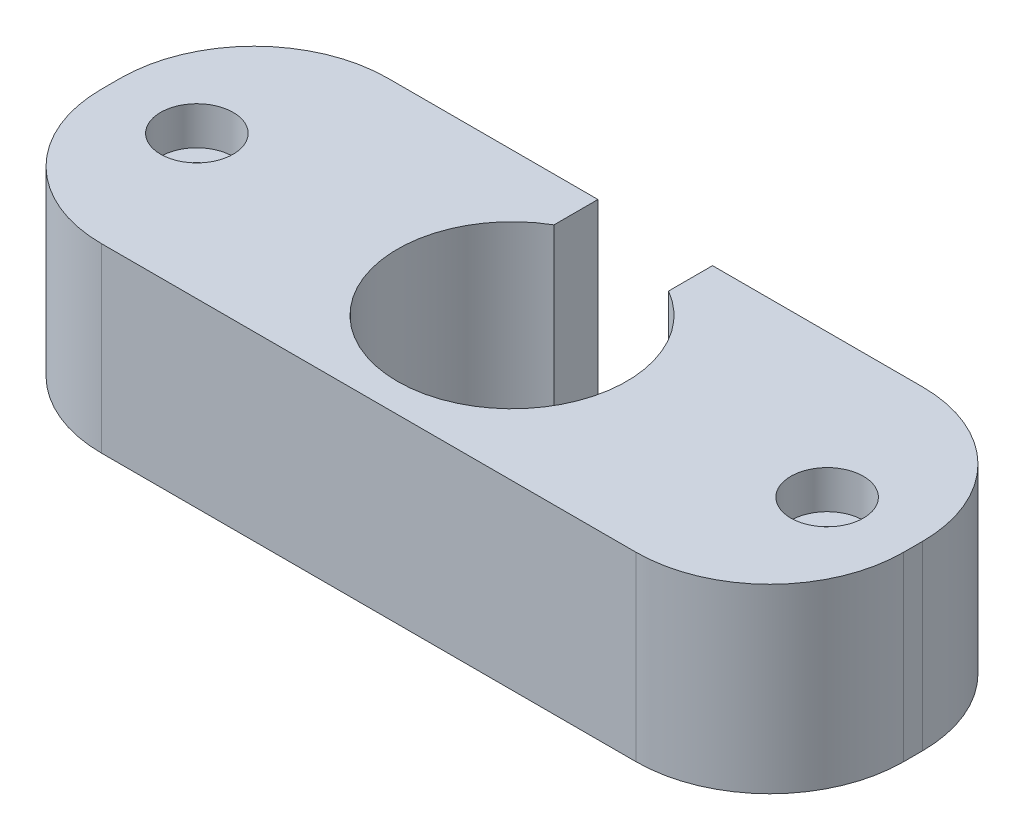
ISO-10303-21;
HEADER;
FILE_DESCRIPTION(('STEP AP214'),'2;1');
FILE_NAME('part.step','',(''),(''),'','','');
FILE_SCHEMA(('AUTOMOTIVE_DESIGN { 1 0 10303 214 1 1 1 1 }'));
ENDSEC;
DATA;
#1=APPLICATION_CONTEXT('core data for automotive mechanical design processes');
#2=APPLICATION_PROTOCOL_DEFINITION('international standard','automotive_design',2000,#1);
#3=PRODUCT_CONTEXT('',#1,'mechanical');
#4=PRODUCT('Part','Part','',(#3));
#5=PRODUCT_RELATED_PRODUCT_CATEGORY('part','',(#4));
#6=PRODUCT_DEFINITION_FORMATION('','',#4);
#7=PRODUCT_DEFINITION_CONTEXT('part definition',#1,'design');
#8=PRODUCT_DEFINITION('design','',#6,#7);
#9=PRODUCT_DEFINITION_SHAPE('','',#8);
#10=(LENGTH_UNIT() NAMED_UNIT(*) SI_UNIT(.MILLI.,.METRE.));
#11=(NAMED_UNIT(*) PLANE_ANGLE_UNIT() SI_UNIT($,.RADIAN.));
#12=(NAMED_UNIT(*) SI_UNIT($,.STERADIAN.) SOLID_ANGLE_UNIT());
#13=UNCERTAINTY_MEASURE_WITH_UNIT(LENGTH_MEASURE(1.E-05),#10,'distance_accuracy_value','');
#14=(GEOMETRIC_REPRESENTATION_CONTEXT(3) GLOBAL_UNCERTAINTY_ASSIGNED_CONTEXT((#13)) GLOBAL_UNIT_ASSIGNED_CONTEXT((#10,
#11,#12)) REPRESENTATION_CONTEXT('',''));
#15=CARTESIAN_POINT('',(0.,0.,0.));
#16=DIRECTION('',(0.,0.,1.));
#17=DIRECTION('',(1.,0.,0.));
#18=AXIS2_PLACEMENT_3D('',#15,#16,#17);
#19=CARTESIAN_POINT('',(0.,-9.5,-15.));
#20=DIRECTION('',(0.,0.,-1.));
#21=DIRECTION('',(-1.,0.,0.));
#22=AXIS2_PLACEMENT_3D('',#19,#20,#21);
#23=PLANE('',#22);
#24=DIRECTION('',(0.,-1.,0.));
#25=VECTOR('',#24,1.);
#26=CARTESIAN_POINT('',(24.,0.,-15.));
#27=LINE('',#26,#25);
#28=CARTESIAN_POINT('',(24.,0.,-15.));
#29=VERTEX_POINT('',#28);
#30=CARTESIAN_POINT('',(24.,-9.5,-15.));
#31=VERTEX_POINT('',#30);
#32=EDGE_CURVE('E128',#29,#31,#27,.T.);
#33=ORIENTED_EDGE('',*,*,#32,.F.);
#34=DIRECTION('',(-1.,0.,0.));
#35=VECTOR('',#34,1.);
#36=CARTESIAN_POINT('',(0.,0.,-15.));
#37=LINE('',#36,#35);
#38=CARTESIAN_POINT('',(35.,0.,-15.));
#39=VERTEX_POINT('',#38);
#40=EDGE_CURVE('E180',#39,#29,#37,.T.);
#41=ORIENTED_EDGE('',*,*,#40,.F.);
#42=DIRECTION('',(0.,1.,0.));
#43=VECTOR('',#42,1.);
#44=CARTESIAN_POINT('',(35.,-9.5,-15.));
#45=LINE('',#44,#43);
#46=CARTESIAN_POINT('',(35.,-9.5,-15.));
#47=VERTEX_POINT('',#46);
#48=EDGE_CURVE('E153',#39,#47,#45,.F.);
#49=ORIENTED_EDGE('',*,*,#48,.T.);
#50=DIRECTION('',(-1.,0.,0.));
#51=VECTOR('',#50,1.);
#52=CARTESIAN_POINT('',(0.,-9.5,-15.));
#53=LINE('',#52,#51);
#54=EDGE_CURVE('E144',#47,#31,#53,.T.);
#55=ORIENTED_EDGE('',*,*,#54,.T.);
#56=EDGE_LOOP('',(#33,#41,#49,#55));
#57=FACE_BOUND('',#56,.T.);
#58=ADVANCED_FACE('F41',(#57),#23,.T.);
#59=CARTESIAN_POINT('',(0.,-9.5,0.));
#60=DIRECTION('',(-1.,0.,0.));
#61=DIRECTION('',(0.,0.,1.));
#62=AXIS2_PLACEMENT_3D('',#59,#60,#61);
#63=PLANE('',#62);
#64=DIRECTION('',(0.,0.,1.));
#65=VECTOR('',#64,1.);
#66=CARTESIAN_POINT('',(0.,-9.5,0.));
#67=LINE('',#66,#65);
#68=CARTESIAN_POINT('',(0.,-9.5,-8.));
#69=VERTEX_POINT('',#68);
#70=CARTESIAN_POINT('',(0.,-9.5,-7.));
#71=VERTEX_POINT('',#70);
#72=EDGE_CURVE('E183',#69,#71,#67,.T.);
#73=ORIENTED_EDGE('',*,*,#72,.T.);
#74=DIRECTION('',(0.,1.,0.));
#75=VECTOR('',#74,1.);
#76=CARTESIAN_POINT('',(0.,-9.5,-7.));
#77=LINE('',#76,#75);
#78=CARTESIAN_POINT('',(0.,0.,-7.));
#79=VERTEX_POINT('',#78);
#80=EDGE_CURVE('E232',#71,#79,#77,.T.);
#81=ORIENTED_EDGE('',*,*,#80,.T.);
#82=DIRECTION('',(0.,0.,1.));
#83=VECTOR('',#82,1.);
#84=CARTESIAN_POINT('',(0.,0.,0.));
#85=LINE('',#84,#83);
#86=CARTESIAN_POINT('',(0.,0.,-8.));
#87=VERTEX_POINT('',#86);
#88=EDGE_CURVE('E166',#87,#79,#85,.T.);
#89=ORIENTED_EDGE('',*,*,#88,.F.);
#90=DIRECTION('',(0.,1.,0.));
#91=VECTOR('',#90,1.);
#92=CARTESIAN_POINT('',(0.,-9.5,-8.));
#93=LINE('',#92,#91);
#94=EDGE_CURVE('E229',#87,#69,#93,.F.);
#95=ORIENTED_EDGE('',*,*,#94,.T.);
#96=EDGE_LOOP('',(#73,#81,#89,#95));
#97=FACE_BOUND('',#96,.T.);
#98=ADVANCED_FACE('F287',(#97),#63,.T.);
#99=DIRECTION('',(0.,1.,0.));
#100=VECTOR('',#99,1.);
#101=CARTESIAN_POINT('',(18.,0.,-15.));
#102=LINE('',#101,#100);
#103=CARTESIAN_POINT('',(18.,-9.5,-15.));
#104=VERTEX_POINT('',#103);
#105=CARTESIAN_POINT('',(18.,0.,-15.));
#106=VERTEX_POINT('',#105);
#107=EDGE_CURVE('E137',#104,#106,#102,.T.);
#108=ORIENTED_EDGE('',*,*,#107,.F.);
#109=CARTESIAN_POINT('',(7.,-9.5,-15.));
#110=VERTEX_POINT('',#109);
#111=EDGE_CURVE('E156',#104,#110,#53,.T.);
#112=ORIENTED_EDGE('',*,*,#111,.T.);
#113=DIRECTION('',(0.,1.,0.));
#114=VECTOR('',#113,1.);
#115=CARTESIAN_POINT('',(7.,-9.5,-15.));
#116=LINE('',#115,#114);
#117=CARTESIAN_POINT('',(7.,0.,-15.));
#118=VERTEX_POINT('',#117);
#119=EDGE_CURVE('E236',#110,#118,#116,.T.);
#120=ORIENTED_EDGE('',*,*,#119,.T.);
#121=EDGE_CURVE('E179',#106,#118,#37,.T.);
#122=ORIENTED_EDGE('',*,*,#121,.F.);
#123=EDGE_LOOP('',(#108,#112,#120,#122));
#124=FACE_BOUND('',#123,.T.);
#125=ADVANCED_FACE('F296',(#124),#23,.T.);
#126=CARTESIAN_POINT('',(42.,-9.5,0.));
#127=DIRECTION('',(1.,0.,0.));
#128=DIRECTION('',(0.,0.,-1.));
#129=AXIS2_PLACEMENT_3D('',#126,#127,#128);
#130=PLANE('',#129);
#131=DIRECTION('',(0.,0.,-1.));
#132=VECTOR('',#131,1.);
#133=CARTESIAN_POINT('',(42.,0.,0.));
#134=LINE('',#133,#132);
#135=CARTESIAN_POINT('',(42.,0.,-7.));
#136=VERTEX_POINT('',#135);
#137=CARTESIAN_POINT('',(42.,0.,-8.));
#138=VERTEX_POINT('',#137);
#139=EDGE_CURVE('E175',#136,#138,#134,.T.);
#140=ORIENTED_EDGE('',*,*,#139,.F.);
#141=DIRECTION('',(0.,1.,0.));
#142=VECTOR('',#141,1.);
#143=CARTESIAN_POINT('',(42.,-9.5,-7.));
#144=LINE('',#143,#142);
#145=CARTESIAN_POINT('',(42.,-9.5,-7.));
#146=VERTEX_POINT('',#145);
#147=EDGE_CURVE('E213',#136,#146,#144,.F.);
#148=ORIENTED_EDGE('',*,*,#147,.T.);
#149=DIRECTION('',(0.,0.,-1.));
#150=VECTOR('',#149,1.);
#151=CARTESIAN_POINT('',(42.,-9.5,0.));
#152=LINE('',#151,#150);
#153=CARTESIAN_POINT('',(42.,-9.5,-8.));
#154=VERTEX_POINT('',#153);
#155=EDGE_CURVE('E162',#146,#154,#152,.T.);
#156=ORIENTED_EDGE('',*,*,#155,.T.);
#157=DIRECTION('',(0.,1.,0.));
#158=VECTOR('',#157,1.);
#159=CARTESIAN_POINT('',(42.,-9.5,-8.));
#160=LINE('',#159,#158);
#161=EDGE_CURVE('E209',#154,#138,#160,.T.);
#162=ORIENTED_EDGE('',*,*,#161,.T.);
#163=EDGE_LOOP('',(#140,#148,#156,#162));
#164=FACE_BOUND('',#163,.T.);
#165=ADVANCED_FACE('F272',(#164),#130,.T.);
#166=CARTESIAN_POINT('',(0.,-9.5,0.));
#167=DIRECTION('',(0.,0.,1.));
#168=DIRECTION('',(1.,0.,0.));
#169=AXIS2_PLACEMENT_3D('',#166,#167,#168);
#170=PLANE('',#169);
#171=DIRECTION('',(1.,0.,0.));
#172=VECTOR('',#171,1.);
#173=CARTESIAN_POINT('',(0.,-9.5,0.));
#174=LINE('',#173,#172);
#175=CARTESIAN_POINT('',(7.,-9.5,0.));
#176=VERTEX_POINT('',#175);
#177=CARTESIAN_POINT('',(35.,-9.5,0.));
#178=VERTEX_POINT('',#177);
#179=EDGE_CURVE('E260',#176,#178,#174,.T.);
#180=ORIENTED_EDGE('',*,*,#179,.T.);
#181=DIRECTION('',(0.,1.,0.));
#182=VECTOR('',#181,1.);
#183=CARTESIAN_POINT('',(35.,-9.5,0.));
#184=LINE('',#183,#182);
#185=CARTESIAN_POINT('',(35.,0.,0.));
#186=VERTEX_POINT('',#185);
#187=EDGE_CURVE('E160',#178,#186,#184,.T.);
#188=ORIENTED_EDGE('',*,*,#187,.T.);
#189=DIRECTION('',(1.,0.,0.));
#190=VECTOR('',#189,1.);
#191=CARTESIAN_POINT('',(0.,0.,0.));
#192=LINE('',#191,#190);
#193=CARTESIAN_POINT('',(7.,0.,0.));
#194=VERTEX_POINT('',#193);
#195=EDGE_CURVE('E170',#194,#186,#192,.T.);
#196=ORIENTED_EDGE('',*,*,#195,.F.);
#197=DIRECTION('',(0.,1.,0.));
#198=VECTOR('',#197,1.);
#199=CARTESIAN_POINT('',(7.,-9.5,0.));
#200=LINE('',#199,#198);
#201=EDGE_CURVE('E155',#194,#176,#200,.F.);
#202=ORIENTED_EDGE('',*,*,#201,.T.);
#203=EDGE_LOOP('',(#180,#188,#196,#202));
#204=FACE_BOUND('',#203,.T.);
#205=ADVANCED_FACE('F351',(#204),#170,.T.);
#206=CARTESIAN_POINT('',(0.,-9.5,0.));
#207=DIRECTION('',(0.,-1.,0.));
#208=DIRECTION('',(0.,0.,-1.));
#209=AXIS2_PLACEMENT_3D('',#206,#207,#208);
#210=PLANE('',#209);
#211=DIRECTION('',(0.,0.,-1.));
#212=VECTOR('',#211,1.);
#213=CARTESIAN_POINT('',(24.,-9.5,-12.));
#214=LINE('',#213,#212);
#215=CARTESIAN_POINT('',(24.,-9.5,-12.6961524227066));
#216=VERTEX_POINT('',#215);
#217=EDGE_CURVE('E65',#216,#31,#214,.T.);
#218=ORIENTED_EDGE('',*,*,#217,.T.);
#219=ORIENTED_EDGE('',*,*,#54,.F.);
#220=CARTESIAN_POINT('',(35.,-9.5,-8.));
#221=DIRECTION('',(0.,-1.,0.));
#222=DIRECTION('',(0.,0.,-1.));
#223=AXIS2_PLACEMENT_3D('',#220,#221,#222);
#224=CIRCLE('',#223,7.);
#225=EDGE_CURVE('E220',#47,#154,#224,.T.);
#226=ORIENTED_EDGE('',*,*,#225,.T.);
#227=ORIENTED_EDGE('',*,*,#155,.F.);
#228=CARTESIAN_POINT('',(35.,-9.5,-7.));
#229=DIRECTION('',(0.,-1.,0.));
#230=DIRECTION('',(0.,0.,-1.));
#231=AXIS2_PLACEMENT_3D('',#228,#229,#230);
#232=CIRCLE('',#231,7.);
#233=EDGE_CURVE('E226',#146,#178,#232,.T.);
#234=ORIENTED_EDGE('',*,*,#233,.T.);
#235=ORIENTED_EDGE('',*,*,#179,.F.);
#236=CARTESIAN_POINT('',(7.,-9.5,-7.));
#237=DIRECTION('',(0.,-1.,0.));
#238=DIRECTION('',(0.,0.,-1.));
#239=AXIS2_PLACEMENT_3D('',#236,#237,#238);
#240=CIRCLE('',#239,7.);
#241=EDGE_CURVE('E223',#176,#71,#240,.T.);
#242=ORIENTED_EDGE('',*,*,#241,.T.);
#243=ORIENTED_EDGE('',*,*,#72,.F.);
#244=CARTESIAN_POINT('',(7.,-9.5,-8.));
#245=DIRECTION('',(0.,-1.,0.));
#246=DIRECTION('',(0.,0.,-1.));
#247=AXIS2_PLACEMENT_3D('',#244,#245,#246);
#248=CIRCLE('',#247,7.);
#249=EDGE_CURVE('E216',#69,#110,#248,.T.);
#250=ORIENTED_EDGE('',*,*,#249,.T.);
#251=ORIENTED_EDGE('',*,*,#111,.F.);
#252=DIRECTION('',(0.,0.,-1.));
#253=VECTOR('',#252,1.);
#254=CARTESIAN_POINT('',(18.,-9.5,-12.));
#255=LINE('',#254,#253);
#256=CARTESIAN_POINT('',(18.,-9.5,-12.6961524227066));
#257=VERTEX_POINT('',#256);
#258=EDGE_CURVE('E150',#257,#104,#255,.T.);
#259=ORIENTED_EDGE('',*,*,#258,.F.);
#260=CARTESIAN_POINT('',(21.,-9.5,-7.5));
#261=DIRECTION('',(0.,-1.,0.));
#262=DIRECTION('',(0.,0.,-1.));
#263=AXIS2_PLACEMENT_3D('',#260,#261,#262);
#264=CIRCLE('',#263,6.);
#265=EDGE_CURVE('E148',#257,#216,#264,.F.);
#266=ORIENTED_EDGE('',*,*,#265,.T.);
#267=EDGE_LOOP('',(#218,#219,#226,#227,#234,#235,#242,#243,#250,#251,#259,#266));
#268=FACE_BOUND('',#267,.T.);
#269=CARTESIAN_POINT('',(37.5,-9.5,-7.49999999999999));
#270=DIRECTION('',(0.,-1.,0.));
#271=DIRECTION('',(0.,0.,-1.));
#272=AXIS2_PLACEMENT_3D('',#269,#270,#271);
#273=CIRCLE('',#272,2.05);
#274=CARTESIAN_POINT('',(37.5,-9.5,-9.54999999999999));
#275=VERTEX_POINT('',#274);
#276=EDGE_CURVE('E315',#275,#275,#273,.T.);
#277=ORIENTED_EDGE('',*,*,#276,.F.);
#278=EDGE_LOOP('',(#277));
#279=FACE_BOUND('',#278,.T.);
#280=CARTESIAN_POINT('',(4.5,-9.5,-7.5));
#281=DIRECTION('',(0.,-1.,0.));
#282=DIRECTION('',(0.,0.,-1.));
#283=AXIS2_PLACEMENT_3D('',#280,#281,#282);
#284=CIRCLE('',#283,2.05);
#285=CARTESIAN_POINT('',(4.5,-9.5,-9.55));
#286=VERTEX_POINT('',#285);
#287=EDGE_CURVE('E192',#286,#286,#284,.T.);
#288=ORIENTED_EDGE('',*,*,#287,.F.);
#289=EDGE_LOOP('',(#288));
#290=FACE_BOUND('',#289,.T.);
#291=ADVANCED_FACE('F142',(#268,#279,#290),#210,.T.);
#292=CARTESIAN_POINT('',(0.,0.,0.));
#293=DIRECTION('',(0.,-1.,0.));
#294=DIRECTION('',(0.,0.,-1.));
#295=AXIS2_PLACEMENT_3D('',#292,#293,#294);
#296=PLANE('',#295);
#297=CARTESIAN_POINT('',(4.5,0.,-7.5));
#298=DIRECTION('',(0.,1.,0.));
#299=DIRECTION('',(0.,0.,1.));
#300=AXIS2_PLACEMENT_3D('',#297,#298,#299);
#301=CIRCLE('',#300,1.9);
#302=CARTESIAN_POINT('',(4.5,0.,-5.6));
#303=VERTEX_POINT('',#302);
#304=EDGE_CURVE('E329',#303,#303,#301,.T.);
#305=ORIENTED_EDGE('',*,*,#304,.F.);
#306=EDGE_LOOP('',(#305));
#307=FACE_BOUND('',#306,.T.);
#308=CARTESIAN_POINT('',(37.5,0.,-7.50000000000001));
#309=DIRECTION('',(0.,1.,0.));
#310=DIRECTION('',(0.,0.,1.));
#311=AXIS2_PLACEMENT_3D('',#308,#309,#310);
#312=CIRCLE('',#311,1.9);
#313=CARTESIAN_POINT('',(37.5,0.,-5.60000000000001));
#314=VERTEX_POINT('',#313);
#315=EDGE_CURVE('E255',#314,#314,#312,.T.);
#316=ORIENTED_EDGE('',*,*,#315,.F.);
#317=EDGE_LOOP('',(#316));
#318=FACE_BOUND('',#317,.T.);
#319=ORIENTED_EDGE('',*,*,#40,.T.);
#320=DIRECTION('',(0.,0.,-1.));
#321=VECTOR('',#320,1.);
#322=CARTESIAN_POINT('',(24.,0.,-12.));
#323=LINE('',#322,#321);
#324=CARTESIAN_POINT('',(24.,0.,-12.6961524227066));
#325=VERTEX_POINT('',#324);
#326=EDGE_CURVE('E131',#325,#29,#323,.T.);
#327=ORIENTED_EDGE('',*,*,#326,.F.);
#328=CARTESIAN_POINT('',(21.,0.,-7.5));
#329=DIRECTION('',(0.,1.,0.));
#330=DIRECTION('',(0.,0.,1.));
#331=AXIS2_PLACEMENT_3D('',#328,#329,#330);
#332=CIRCLE('',#331,6.);
#333=CARTESIAN_POINT('',(18.,0.,-12.6961524227066));
#334=VERTEX_POINT('',#333);
#335=EDGE_CURVE('E171',#334,#325,#332,.T.);
#336=ORIENTED_EDGE('',*,*,#335,.F.);
#337=DIRECTION('',(0.,0.,-1.));
#338=VECTOR('',#337,1.);
#339=CARTESIAN_POINT('',(18.,0.,-12.));
#340=LINE('',#339,#338);
#341=EDGE_CURVE('E57',#334,#106,#340,.T.);
#342=ORIENTED_EDGE('',*,*,#341,.T.);
#343=ORIENTED_EDGE('',*,*,#121,.T.);
#344=CARTESIAN_POINT('',(7.,0.,-8.));
#345=DIRECTION('',(0.,-1.,0.));
#346=DIRECTION('',(0.,0.,-1.));
#347=AXIS2_PLACEMENT_3D('',#344,#345,#346);
#348=CIRCLE('',#347,7.);
#349=EDGE_CURVE('E197',#118,#87,#348,.F.);
#350=ORIENTED_EDGE('',*,*,#349,.T.);
#351=ORIENTED_EDGE('',*,*,#88,.T.);
#352=CARTESIAN_POINT('',(7.,0.,-7.));
#353=DIRECTION('',(0.,-1.,0.));
#354=DIRECTION('',(0.,0.,-1.));
#355=AXIS2_PLACEMENT_3D('',#352,#353,#354);
#356=CIRCLE('',#355,7.);
#357=EDGE_CURVE('E203',#79,#194,#356,.F.);
#358=ORIENTED_EDGE('',*,*,#357,.T.);
#359=ORIENTED_EDGE('',*,*,#195,.T.);
#360=CARTESIAN_POINT('',(35.,0.,-7.));
#361=DIRECTION('',(0.,-1.,0.));
#362=DIRECTION('',(0.,0.,-1.));
#363=AXIS2_PLACEMENT_3D('',#360,#361,#362);
#364=CIRCLE('',#363,7.);
#365=EDGE_CURVE('E206',#186,#136,#364,.F.);
#366=ORIENTED_EDGE('',*,*,#365,.T.);
#367=ORIENTED_EDGE('',*,*,#139,.T.);
#368=CARTESIAN_POINT('',(35.,0.,-8.));
#369=DIRECTION('',(0.,-1.,0.));
#370=DIRECTION('',(0.,0.,-1.));
#371=AXIS2_PLACEMENT_3D('',#368,#369,#370);
#372=CIRCLE('',#371,7.);
#373=EDGE_CURVE('E200',#138,#39,#372,.F.);
#374=ORIENTED_EDGE('',*,*,#373,.T.);
#375=EDGE_LOOP('',(#319,#327,#336,#342,#343,#350,#351,#358,#359,#366,#367,#374));
#376=FACE_BOUND('',#375,.T.);
#377=ADVANCED_FACE('F247',(#307,#318,#376),#296,.F.);
#378=CARTESIAN_POINT('',(21.,-9.501,-7.5));
#379=DIRECTION('',(0.,1.,0.));
#380=DIRECTION('',(0.,0.,1.));
#381=AXIS2_PLACEMENT_3D('',#378,#379,#380);
#382=CYLINDRICAL_SURFACE('',#381,6.);
#383=ORIENTED_EDGE('',*,*,#335,.T.);
#384=DIRECTION('',(0.,1.,0.));
#385=VECTOR('',#384,1.);
#386=CARTESIAN_POINT('',(24.,-9.501,-12.6961524227066));
#387=LINE('',#386,#385);
#388=EDGE_CURVE('E11',#325,#216,#387,.F.);
#389=ORIENTED_EDGE('',*,*,#388,.T.);
#390=ORIENTED_EDGE('',*,*,#265,.F.);
#391=DIRECTION('',(0.,1.,0.));
#392=VECTOR('',#391,1.);
#393=CARTESIAN_POINT('',(18.,-9.501,-12.6961524227066));
#394=LINE('',#393,#392);
#395=EDGE_CURVE('E50',#257,#334,#394,.T.);
#396=ORIENTED_EDGE('',*,*,#395,.T.);
#397=EDGE_LOOP('',(#383,#389,#390,#396));
#398=FACE_BOUND('',#397,.T.);
#399=ADVANCED_FACE('F245',(#398),#382,.F.);
#400=CARTESIAN_POINT('',(37.5,-2.,-7.50000000000001));
#401=DIRECTION('',(0.,1.,0.));
#402=DIRECTION('',(0.,0.,1.));
#403=AXIS2_PLACEMENT_3D('',#400,#401,#402);
#404=CYLINDRICAL_SURFACE('',#403,1.9);
#405=CARTESIAN_POINT('',(37.5,-2.,-7.50000000000001));
#406=DIRECTION('',(0.,1.,0.));
#407=DIRECTION('',(0.,0.,1.));
#408=AXIS2_PLACEMENT_3D('',#405,#406,#407);
#409=CIRCLE('',#408,1.9);
#410=CARTESIAN_POINT('',(37.5,-2.,-5.60000000000001));
#411=VERTEX_POINT('',#410);
#412=EDGE_CURVE('E332',#411,#411,#409,.T.);
#413=ORIENTED_EDGE('',*,*,#412,.F.);
#414=EDGE_LOOP('',(#413));
#415=FACE_BOUND('',#414,.T.);
#416=ORIENTED_EDGE('',*,*,#315,.T.);
#417=EDGE_LOOP('',(#416));
#418=FACE_BOUND('',#417,.T.);
#419=ADVANCED_FACE('F341',(#415,#418),#404,.F.);
#420=CARTESIAN_POINT('',(37.5,-2.,-7.50000000000001));
#421=DIRECTION('',(0.,1.,0.));
#422=DIRECTION('',(0.,0.,1.));
#423=AXIS2_PLACEMENT_3D('',#420,#421,#422);
#424=PLANE('',#423);
#425=CARTESIAN_POINT('',(37.5,-2.,-7.50000000000001));
#426=DIRECTION('',(0.,1.,0.));
#427=DIRECTION('',(0.,0.,1.));
#428=AXIS2_PLACEMENT_3D('',#425,#426,#427);
#429=CIRCLE('',#428,0.950000000000001);
#430=CARTESIAN_POINT('',(37.5,-2.,-6.55000000000001));
#431=VERTEX_POINT('',#430);
#432=EDGE_CURVE('E307',#431,#431,#429,.T.);
#433=ORIENTED_EDGE('',*,*,#432,.F.);
#434=EDGE_LOOP('',(#433));
#435=FACE_BOUND('',#434,.T.);
#436=ORIENTED_EDGE('',*,*,#412,.T.);
#437=EDGE_LOOP('',(#436));
#438=FACE_BOUND('',#437,.T.);
#439=ADVANCED_FACE('F418',(#435,#438),#424,.T.);
#440=CARTESIAN_POINT('',(4.5,-2.,-7.5));
#441=DIRECTION('',(0.,1.,0.));
#442=DIRECTION('',(0.,0.,1.));
#443=AXIS2_PLACEMENT_3D('',#440,#441,#442);
#444=CYLINDRICAL_SURFACE('',#443,1.9);
#445=CARTESIAN_POINT('',(4.5,-2.,-7.5));
#446=DIRECTION('',(0.,1.,0.));
#447=DIRECTION('',(0.,0.,1.));
#448=AXIS2_PLACEMENT_3D('',#445,#446,#447);
#449=CIRCLE('',#448,1.9);
#450=CARTESIAN_POINT('',(4.5,-2.,-5.6));
#451=VERTEX_POINT('',#450);
#452=EDGE_CURVE('E252',#451,#451,#449,.T.);
#453=ORIENTED_EDGE('',*,*,#452,.F.);
#454=EDGE_LOOP('',(#453));
#455=FACE_BOUND('',#454,.T.);
#456=ORIENTED_EDGE('',*,*,#304,.T.);
#457=EDGE_LOOP('',(#456));
#458=FACE_BOUND('',#457,.T.);
#459=ADVANCED_FACE('F414',(#455,#458),#444,.F.);
#460=CARTESIAN_POINT('',(4.5,-2.,-7.5));
#461=DIRECTION('',(0.,1.,0.));
#462=DIRECTION('',(0.,0.,1.));
#463=AXIS2_PLACEMENT_3D('',#460,#461,#462);
#464=PLANE('',#463);
#465=CARTESIAN_POINT('',(4.5,-2.,-7.5));
#466=DIRECTION('',(0.,1.,0.));
#467=DIRECTION('',(0.,0.,1.));
#468=AXIS2_PLACEMENT_3D('',#465,#466,#467);
#469=CIRCLE('',#468,0.949999999999999);
#470=CARTESIAN_POINT('',(4.5,-2.,-6.55));
#471=VERTEX_POINT('',#470);
#472=EDGE_CURVE('E189',#471,#471,#469,.T.);
#473=ORIENTED_EDGE('',*,*,#472,.F.);
#474=EDGE_LOOP('',(#473));
#475=FACE_BOUND('',#474,.T.);
#476=ORIENTED_EDGE('',*,*,#452,.T.);
#477=EDGE_LOOP('',(#476));
#478=FACE_BOUND('',#477,.T.);
#479=ADVANCED_FACE('F410',(#475,#478),#464,.T.);
#480=CARTESIAN_POINT('',(4.5,-4.5,-7.5));
#481=DIRECTION('',(0.,-1.,0.));
#482=DIRECTION('',(0.,0.,-1.));
#483=AXIS2_PLACEMENT_3D('',#480,#481,#482);
#484=CYLINDRICAL_SURFACE('',#483,2.05);
#485=CARTESIAN_POINT('',(4.5,-4.5,-7.5));
#486=DIRECTION('',(0.,-1.,0.));
#487=DIRECTION('',(0.,0.,-1.));
#488=AXIS2_PLACEMENT_3D('',#485,#486,#487);
#489=CIRCLE('',#488,2.05);
#490=CARTESIAN_POINT('',(4.5,-4.5,-9.55));
#491=VERTEX_POINT('',#490);
#492=EDGE_CURVE('E319',#491,#491,#489,.T.);
#493=ORIENTED_EDGE('',*,*,#492,.F.);
#494=EDGE_LOOP('',(#493));
#495=FACE_BOUND('',#494,.T.);
#496=ORIENTED_EDGE('',*,*,#287,.T.);
#497=EDGE_LOOP('',(#496));
#498=FACE_BOUND('',#497,.T.);
#499=ADVANCED_FACE('F406',(#495,#498),#484,.F.);
#500=CARTESIAN_POINT('',(4.5,-4.5,-7.5));
#501=DIRECTION('',(0.,-1.,0.));
#502=DIRECTION('',(0.,0.,-1.));
#503=AXIS2_PLACEMENT_3D('',#500,#501,#502);
#504=PLANE('',#503);
#505=CARTESIAN_POINT('',(4.5,-4.5,-7.5));
#506=DIRECTION('',(0.,-1.,0.));
#507=DIRECTION('',(0.,0.,-1.));
#508=AXIS2_PLACEMENT_3D('',#505,#506,#507);
#509=CIRCLE('',#508,0.949999999999999);
#510=CARTESIAN_POINT('',(4.5,-4.5,-8.45));
#511=VERTEX_POINT('',#510);
#512=EDGE_CURVE('E188',#511,#511,#509,.T.);
#513=ORIENTED_EDGE('',*,*,#512,.F.);
#514=EDGE_LOOP('',(#513));
#515=FACE_BOUND('',#514,.T.);
#516=ORIENTED_EDGE('',*,*,#492,.T.);
#517=EDGE_LOOP('',(#516));
#518=FACE_BOUND('',#517,.T.);
#519=ADVANCED_FACE('F402',(#515,#518),#504,.T.);
#520=CARTESIAN_POINT('',(37.5,-4.5,-7.49999999999999));
#521=DIRECTION('',(0.,-1.,0.));
#522=DIRECTION('',(0.,0.,-1.));
#523=AXIS2_PLACEMENT_3D('',#520,#521,#522);
#524=CYLINDRICAL_SURFACE('',#523,2.05);
#525=CARTESIAN_POINT('',(37.5,-4.5,-7.49999999999999));
#526=DIRECTION('',(0.,-1.,0.));
#527=DIRECTION('',(0.,0.,-1.));
#528=AXIS2_PLACEMENT_3D('',#525,#526,#527);
#529=CIRCLE('',#528,2.05);
#530=CARTESIAN_POINT('',(37.5,-4.5,-9.54999999999999));
#531=VERTEX_POINT('',#530);
#532=EDGE_CURVE('E311',#531,#531,#529,.T.);
#533=ORIENTED_EDGE('',*,*,#532,.F.);
#534=EDGE_LOOP('',(#533));
#535=FACE_BOUND('',#534,.T.);
#536=ORIENTED_EDGE('',*,*,#276,.T.);
#537=EDGE_LOOP('',(#536));
#538=FACE_BOUND('',#537,.T.);
#539=ADVANCED_FACE('F398',(#535,#538),#524,.F.);
#540=CARTESIAN_POINT('',(37.5,-4.5,-7.49999999999999));
#541=DIRECTION('',(0.,-1.,0.));
#542=DIRECTION('',(0.,0.,-1.));
#543=AXIS2_PLACEMENT_3D('',#540,#541,#542);
#544=PLANE('',#543);
#545=CARTESIAN_POINT('',(37.5,-4.5,-7.50000000000001));
#546=DIRECTION('',(0.,-1.,0.));
#547=DIRECTION('',(0.,0.,-1.));
#548=AXIS2_PLACEMENT_3D('',#545,#546,#547);
#549=CIRCLE('',#548,0.950000000000001);
#550=CARTESIAN_POINT('',(37.5,-4.5,-8.45000000000001));
#551=VERTEX_POINT('',#550);
#552=EDGE_CURVE('E184',#551,#551,#549,.T.);
#553=ORIENTED_EDGE('',*,*,#552,.F.);
#554=EDGE_LOOP('',(#553));
#555=FACE_BOUND('',#554,.T.);
#556=ORIENTED_EDGE('',*,*,#532,.T.);
#557=EDGE_LOOP('',(#556));
#558=FACE_BOUND('',#557,.T.);
#559=ADVANCED_FACE('F394',(#555,#558),#544,.T.);
#560=CARTESIAN_POINT('',(37.5,-5.,-7.50000000000001));
#561=DIRECTION('',(0.,1.,0.));
#562=DIRECTION('',(0.,0.,1.));
#563=AXIS2_PLACEMENT_3D('',#560,#561,#562);
#564=CYLINDRICAL_SURFACE('',#563,0.950000000000001);
#565=ORIENTED_EDGE('',*,*,#552,.T.);
#566=EDGE_LOOP('',(#565));
#567=FACE_BOUND('',#566,.T.);
#568=ORIENTED_EDGE('',*,*,#432,.T.);
#569=EDGE_LOOP('',(#568));
#570=FACE_BOUND('',#569,.T.);
#571=ADVANCED_FACE('F390',(#567,#570),#564,.F.);
#572=CARTESIAN_POINT('',(4.5,-5.,-7.5));
#573=DIRECTION('',(0.,1.,0.));
#574=DIRECTION('',(0.,0.,1.));
#575=AXIS2_PLACEMENT_3D('',#572,#573,#574);
#576=CYLINDRICAL_SURFACE('',#575,0.949999999999999);
#577=ORIENTED_EDGE('',*,*,#512,.T.);
#578=EDGE_LOOP('',(#577));
#579=FACE_BOUND('',#578,.T.);
#580=ORIENTED_EDGE('',*,*,#472,.T.);
#581=EDGE_LOOP('',(#580));
#582=FACE_BOUND('',#581,.T.);
#583=ADVANCED_FACE('F372',(#579,#582),#576,.F.);
#584=CARTESIAN_POINT('',(35.,-9.5,-7.));
#585=DIRECTION('',(0.,1.,0.));
#586=DIRECTION('',(0.,0.,1.));
#587=AXIS2_PLACEMENT_3D('',#584,#585,#586);
#588=CYLINDRICAL_SURFACE('',#587,7.);
#589=ORIENTED_EDGE('',*,*,#233,.F.);
#590=ORIENTED_EDGE('',*,*,#147,.F.);
#591=ORIENTED_EDGE('',*,*,#365,.F.);
#592=ORIENTED_EDGE('',*,*,#187,.F.);
#593=EDGE_LOOP('',(#589,#590,#591,#592));
#594=FACE_BOUND('',#593,.T.);
#595=ADVANCED_FACE('F278',(#594),#588,.T.);
#596=CARTESIAN_POINT('',(7.,-9.5,-7.));
#597=DIRECTION('',(0.,1.,0.));
#598=DIRECTION('',(0.,0.,1.));
#599=AXIS2_PLACEMENT_3D('',#596,#597,#598);
#600=CYLINDRICAL_SURFACE('',#599,7.);
#601=ORIENTED_EDGE('',*,*,#241,.F.);
#602=ORIENTED_EDGE('',*,*,#201,.F.);
#603=ORIENTED_EDGE('',*,*,#357,.F.);
#604=ORIENTED_EDGE('',*,*,#80,.F.);
#605=EDGE_LOOP('',(#601,#602,#603,#604));
#606=FACE_BOUND('',#605,.T.);
#607=ADVANCED_FACE('F284',(#606),#600,.T.);
#608=CARTESIAN_POINT('',(35.,-9.5,-8.));
#609=DIRECTION('',(0.,1.,0.));
#610=DIRECTION('',(0.,0.,1.));
#611=AXIS2_PLACEMENT_3D('',#608,#609,#610);
#612=CYLINDRICAL_SURFACE('',#611,7.);
#613=ORIENTED_EDGE('',*,*,#225,.F.);
#614=ORIENTED_EDGE('',*,*,#48,.F.);
#615=ORIENTED_EDGE('',*,*,#373,.F.);
#616=ORIENTED_EDGE('',*,*,#161,.F.);
#617=EDGE_LOOP('',(#613,#614,#615,#616));
#618=FACE_BOUND('',#617,.T.);
#619=ADVANCED_FACE('F276',(#618),#612,.T.);
#620=CARTESIAN_POINT('',(7.,-9.5,-8.));
#621=DIRECTION('',(0.,1.,0.));
#622=DIRECTION('',(0.,0.,1.));
#623=AXIS2_PLACEMENT_3D('',#620,#621,#622);
#624=CYLINDRICAL_SURFACE('',#623,7.);
#625=ORIENTED_EDGE('',*,*,#249,.F.);
#626=ORIENTED_EDGE('',*,*,#94,.F.);
#627=ORIENTED_EDGE('',*,*,#349,.F.);
#628=ORIENTED_EDGE('',*,*,#119,.F.);
#629=EDGE_LOOP('',(#625,#626,#627,#628));
#630=FACE_BOUND('',#629,.T.);
#631=ADVANCED_FACE('F43',(#630),#624,.T.);
#632=CARTESIAN_POINT('',(18.,0.,-12.));
#633=DIRECTION('',(-1.,0.,0.));
#634=DIRECTION('',(0.,0.,1.));
#635=AXIS2_PLACEMENT_3D('',#632,#633,#634);
#636=PLANE('',#635);
#637=ORIENTED_EDGE('',*,*,#258,.T.);
#638=ORIENTED_EDGE('',*,*,#107,.T.);
#639=ORIENTED_EDGE('',*,*,#341,.F.);
#640=ORIENTED_EDGE('',*,*,#395,.F.);
#641=EDGE_LOOP('',(#637,#638,#639,#640));
#642=FACE_BOUND('',#641,.T.);
#643=ADVANCED_FACE('F378',(#642),#636,.F.);
#644=CARTESIAN_POINT('',(24.,0.,-12.));
#645=DIRECTION('',(1.,0.,0.));
#646=DIRECTION('',(0.,0.,-1.));
#647=AXIS2_PLACEMENT_3D('',#644,#645,#646);
#648=PLANE('',#647);
#649=ORIENTED_EDGE('',*,*,#326,.T.);
#650=ORIENTED_EDGE('',*,*,#32,.T.);
#651=ORIENTED_EDGE('',*,*,#217,.F.);
#652=ORIENTED_EDGE('',*,*,#388,.F.);
#653=EDGE_LOOP('',(#649,#650,#651,#652));
#654=FACE_BOUND('',#653,.T.);
#655=ADVANCED_FACE('F129',(#654),#648,.F.);
#656=CLOSED_SHELL('',(#58,#98,#125,#165,#205,#291,#377,#399,#419,#439,#459,#479,#499,#519,#539,
#559,#571,#583,#595,#607,#619,#631,#643,#655));
#657=MANIFOLD_SOLID_BREP('B2',#656);
#658=ADVANCED_BREP_SHAPE_REPRESENTATION('',(#18,#657),#14);
#659=SHAPE_DEFINITION_REPRESENTATION(#9,#658);
ENDSEC;
END-ISO-10303-21;
